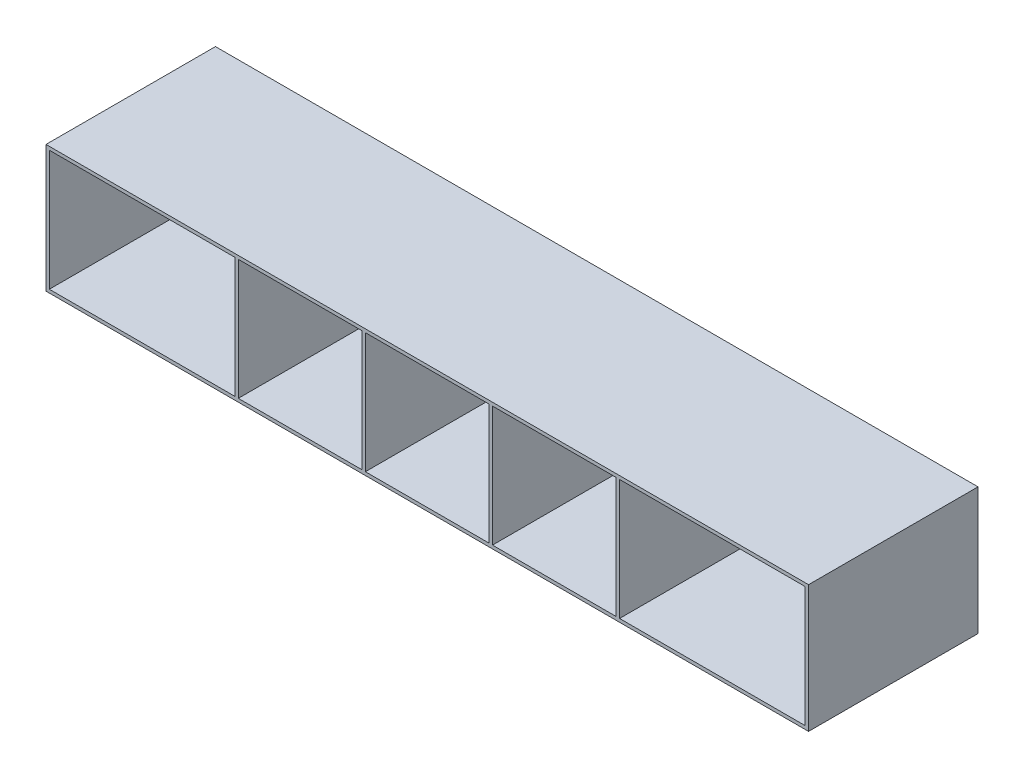
ISO-10303-21;
HEADER;
FILE_DESCRIPTION(('STEP AP214'),'2;1');
FILE_NAME('part.step','',(''),(''),'','','');
FILE_SCHEMA(('AUTOMOTIVE_DESIGN { 1 0 10303 214 1 1 1 1 }'));
ENDSEC;
DATA;
#1=APPLICATION_CONTEXT('core data for automotive mechanical design processes');
#2=APPLICATION_PROTOCOL_DEFINITION('international standard','automotive_design',2000,#1);
#3=PRODUCT_CONTEXT('',#1,'mechanical');
#4=PRODUCT('Part','Part','',(#3));
#5=PRODUCT_RELATED_PRODUCT_CATEGORY('part','',(#4));
#6=PRODUCT_DEFINITION_FORMATION('','',#4);
#7=PRODUCT_DEFINITION_CONTEXT('part definition',#1,'design');
#8=PRODUCT_DEFINITION('design','',#6,#7);
#9=PRODUCT_DEFINITION_SHAPE('','',#8);
#10=(LENGTH_UNIT() NAMED_UNIT(*) SI_UNIT(.MILLI.,.METRE.));
#11=(NAMED_UNIT(*) PLANE_ANGLE_UNIT() SI_UNIT($,.RADIAN.));
#12=(NAMED_UNIT(*) SI_UNIT($,.STERADIAN.) SOLID_ANGLE_UNIT());
#13=UNCERTAINTY_MEASURE_WITH_UNIT(LENGTH_MEASURE(1.E-05),#10,'distance_accuracy_value','');
#14=(GEOMETRIC_REPRESENTATION_CONTEXT(3) GLOBAL_UNCERTAINTY_ASSIGNED_CONTEXT((#13)) GLOBAL_UNIT_ASSIGNED_CONTEXT((#10,
#11,#12)) REPRESENTATION_CONTEXT('',''));
#15=CARTESIAN_POINT('',(0.,0.,0.));
#16=DIRECTION('',(0.,0.,1.));
#17=DIRECTION('',(1.,0.,0.));
#18=AXIS2_PLACEMENT_3D('',#15,#16,#17);
#19=CARTESIAN_POINT('',(0.,0.,101.6));
#20=DIRECTION('',(0.,0.,1.));
#21=DIRECTION('',(1.,0.,0.));
#22=AXIS2_PLACEMENT_3D('',#19,#20,#21);
#23=PLANE('',#22);
#24=DIRECTION('',(0.,1.,0.));
#25=VECTOR('',#24,1.);
#26=CARTESIAN_POINT('',(115.3,0.,101.6));
#27=LINE('',#26,#25);
#28=CARTESIAN_POINT('',(115.3,-36.1,101.6));
#29=VERTEX_POINT('',#28);
#30=CARTESIAN_POINT('',(115.3,36.1,101.6));
#31=VERTEX_POINT('',#30);
#32=EDGE_CURVE('E207',#29,#31,#27,.T.);
#33=ORIENTED_EDGE('',*,*,#32,.T.);
#34=DIRECTION('',(1.,0.,0.));
#35=VECTOR('',#34,1.);
#36=CARTESIAN_POINT('',(0.,36.1,101.6));
#37=LINE('',#36,#35);
#38=CARTESIAN_POINT('',(226.6,36.1,101.6));
#39=VERTEX_POINT('',#38);
#40=EDGE_CURVE('E217',#31,#39,#37,.T.);
#41=ORIENTED_EDGE('',*,*,#40,.T.);
#42=DIRECTION('',(0.,-1.,0.));
#43=VECTOR('',#42,1.);
#44=CARTESIAN_POINT('',(226.6,0.,101.6));
#45=LINE('',#44,#43);
#46=CARTESIAN_POINT('',(226.6,-36.1,101.6));
#47=VERTEX_POINT('',#46);
#48=EDGE_CURVE('E50',#39,#47,#45,.T.);
#49=ORIENTED_EDGE('',*,*,#48,.T.);
#50=DIRECTION('',(1.,0.,0.));
#51=VECTOR('',#50,1.);
#52=CARTESIAN_POINT('',(0.,-36.1,101.6));
#53=LINE('',#52,#51);
#54=EDGE_CURVE('E200',#29,#47,#53,.T.);
#55=ORIENTED_EDGE('',*,*,#54,.F.);
#56=EDGE_LOOP('',(#33,#41,#49,#55));
#57=FACE_BOUND('',#56,.T.);
#58=DIRECTION('',(0.,-1.,0.));
#59=VECTOR('',#58,1.);
#60=CARTESIAN_POINT('',(-228.6,38.1,101.6));
#61=LINE('',#60,#59);
#62=CARTESIAN_POINT('',(-228.6,38.1,101.6));
#63=VERTEX_POINT('',#62);
#64=CARTESIAN_POINT('',(-228.6,-38.1,101.6));
#65=VERTEX_POINT('',#64);
#66=EDGE_CURVE('E359',#63,#65,#61,.T.);
#67=ORIENTED_EDGE('',*,*,#66,.T.);
#68=DIRECTION('',(1.,0.,0.));
#69=VECTOR('',#68,1.);
#70=CARTESIAN_POINT('',(-228.6,-38.1,101.6));
#71=LINE('',#70,#69);
#72=CARTESIAN_POINT('',(228.6,-38.1,101.6));
#73=VERTEX_POINT('',#72);
#74=EDGE_CURVE('E362',#65,#73,#71,.T.);
#75=ORIENTED_EDGE('',*,*,#74,.T.);
#76=DIRECTION('',(0.,-1.,0.));
#77=VECTOR('',#76,1.);
#78=CARTESIAN_POINT('',(228.6,38.1,101.6));
#79=LINE('',#78,#77);
#80=CARTESIAN_POINT('',(228.6,38.1,101.6));
#81=VERTEX_POINT('',#80);
#82=EDGE_CURVE('E365',#81,#73,#79,.T.);
#83=ORIENTED_EDGE('',*,*,#82,.F.);
#84=DIRECTION('',(1.,0.,0.));
#85=VECTOR('',#84,1.);
#86=CARTESIAN_POINT('',(-228.6,38.1,101.6));
#87=LINE('',#86,#85);
#88=EDGE_CURVE('E368',#63,#81,#87,.T.);
#89=ORIENTED_EDGE('',*,*,#88,.F.);
#90=EDGE_LOOP('',(#67,#75,#83,#89));
#91=FACE_BOUND('',#90,.T.);
#92=DIRECTION('',(0.,1.,0.));
#93=VECTOR('',#92,1.);
#94=CARTESIAN_POINT('',(-115.3,0.,101.6));
#95=LINE('',#94,#93);
#96=CARTESIAN_POINT('',(-115.3,-36.1,101.6));
#97=VERTEX_POINT('',#96);
#98=CARTESIAN_POINT('',(-115.3,36.1,101.6));
#99=VERTEX_POINT('',#98);
#100=EDGE_CURVE('E330',#97,#99,#95,.T.);
#101=ORIENTED_EDGE('',*,*,#100,.F.);
#102=DIRECTION('',(1.,0.,0.));
#103=VECTOR('',#102,1.);
#104=CARTESIAN_POINT('',(0.,-36.1,101.6));
#105=LINE('',#104,#103);
#106=CARTESIAN_POINT('',(-226.6,-36.1,101.6));
#107=VERTEX_POINT('',#106);
#108=EDGE_CURVE('E328',#107,#97,#105,.T.);
#109=ORIENTED_EDGE('',*,*,#108,.F.);
#110=DIRECTION('',(0.,-1.,0.));
#111=VECTOR('',#110,1.);
#112=CARTESIAN_POINT('',(-226.6,0.,101.6));
#113=LINE('',#112,#111);
#114=CARTESIAN_POINT('',(-226.6,36.1,101.6));
#115=VERTEX_POINT('',#114);
#116=EDGE_CURVE('E336',#115,#107,#113,.T.);
#117=ORIENTED_EDGE('',*,*,#116,.F.);
#118=DIRECTION('',(1.,0.,0.));
#119=VECTOR('',#118,1.);
#120=CARTESIAN_POINT('',(0.,36.1,101.6));
#121=LINE('',#120,#119);
#122=EDGE_CURVE('E333',#115,#99,#121,.T.);
#123=ORIENTED_EDGE('',*,*,#122,.T.);
#124=EDGE_LOOP('',(#101,#109,#117,#123));
#125=FACE_BOUND('',#124,.T.);
#126=DIRECTION('',(0.,1.,0.));
#127=VECTOR('',#126,1.);
#128=CARTESIAN_POINT('',(113.3,0.,101.6));
#129=LINE('',#128,#127);
#130=CARTESIAN_POINT('',(113.3,-36.1,101.6));
#131=VERTEX_POINT('',#130);
#132=CARTESIAN_POINT('',(113.3,36.1,101.6));
#133=VERTEX_POINT('',#132);
#134=EDGE_CURVE('E298',#131,#133,#129,.T.);
#135=ORIENTED_EDGE('',*,*,#134,.F.);
#136=DIRECTION('',(1.,0.,0.));
#137=VECTOR('',#136,1.);
#138=CARTESIAN_POINT('',(0.,-36.1,101.6));
#139=LINE('',#138,#137);
#140=CARTESIAN_POINT('',(39.1,-36.1,101.6));
#141=VERTEX_POINT('',#140);
#142=EDGE_CURVE('E296',#141,#131,#139,.T.);
#143=ORIENTED_EDGE('',*,*,#142,.F.);
#144=DIRECTION('',(0.,1.,0.));
#145=VECTOR('',#144,1.);
#146=CARTESIAN_POINT('',(39.1,0.,101.6));
#147=LINE('',#146,#145);
#148=CARTESIAN_POINT('',(39.1,36.1,101.6));
#149=VERTEX_POINT('',#148);
#150=EDGE_CURVE('E304',#141,#149,#147,.T.);
#151=ORIENTED_EDGE('',*,*,#150,.T.);
#152=DIRECTION('',(1.,0.,0.));
#153=VECTOR('',#152,1.);
#154=CARTESIAN_POINT('',(0.,36.1,101.6));
#155=LINE('',#154,#153);
#156=EDGE_CURVE('E301',#149,#133,#155,.T.);
#157=ORIENTED_EDGE('',*,*,#156,.T.);
#158=EDGE_LOOP('',(#135,#143,#151,#157));
#159=FACE_BOUND('',#158,.T.);
#160=DIRECTION('',(0.,1.,0.));
#161=VECTOR('',#160,1.);
#162=CARTESIAN_POINT('',(37.1,0.,101.6));
#163=LINE('',#162,#161);
#164=CARTESIAN_POINT('',(37.1,-36.1,101.6));
#165=VERTEX_POINT('',#164);
#166=CARTESIAN_POINT('',(37.1,36.1,101.6));
#167=VERTEX_POINT('',#166);
#168=EDGE_CURVE('E266',#165,#167,#163,.T.);
#169=ORIENTED_EDGE('',*,*,#168,.F.);
#170=DIRECTION('',(1.,0.,0.));
#171=VECTOR('',#170,1.);
#172=CARTESIAN_POINT('',(0.,-36.1,101.6));
#173=LINE('',#172,#171);
#174=CARTESIAN_POINT('',(-37.1,-36.1,101.6));
#175=VERTEX_POINT('',#174);
#176=EDGE_CURVE('E264',#175,#165,#173,.T.);
#177=ORIENTED_EDGE('',*,*,#176,.F.);
#178=DIRECTION('',(0.,1.,0.));
#179=VECTOR('',#178,1.);
#180=CARTESIAN_POINT('',(-37.1,0.,101.6));
#181=LINE('',#180,#179);
#182=CARTESIAN_POINT('',(-37.1,36.1,101.6));
#183=VERTEX_POINT('',#182);
#184=EDGE_CURVE('E272',#175,#183,#181,.T.);
#185=ORIENTED_EDGE('',*,*,#184,.T.);
#186=DIRECTION('',(1.,0.,0.));
#187=VECTOR('',#186,1.);
#188=CARTESIAN_POINT('',(0.,36.1,101.6));
#189=LINE('',#188,#187);
#190=EDGE_CURVE('E269',#183,#167,#189,.T.);
#191=ORIENTED_EDGE('',*,*,#190,.T.);
#192=EDGE_LOOP('',(#169,#177,#185,#191));
#193=FACE_BOUND('',#192,.T.);
#194=DIRECTION('',(0.,1.,0.));
#195=VECTOR('',#194,1.);
#196=CARTESIAN_POINT('',(-39.1,0.,101.6));
#197=LINE('',#196,#195);
#198=CARTESIAN_POINT('',(-39.1,-36.1,101.6));
#199=VERTEX_POINT('',#198);
#200=CARTESIAN_POINT('',(-39.1,36.1,101.6));
#201=VERTEX_POINT('',#200);
#202=EDGE_CURVE('E234',#199,#201,#197,.T.);
#203=ORIENTED_EDGE('',*,*,#202,.F.);
#204=DIRECTION('',(1.,0.,0.));
#205=VECTOR('',#204,1.);
#206=CARTESIAN_POINT('',(0.,-36.1,101.6));
#207=LINE('',#206,#205);
#208=CARTESIAN_POINT('',(-113.3,-36.1,101.6));
#209=VERTEX_POINT('',#208);
#210=EDGE_CURVE('E232',#209,#199,#207,.T.);
#211=ORIENTED_EDGE('',*,*,#210,.F.);
#212=DIRECTION('',(0.,1.,0.));
#213=VECTOR('',#212,1.);
#214=CARTESIAN_POINT('',(-113.3,0.,101.6));
#215=LINE('',#214,#213);
#216=CARTESIAN_POINT('',(-113.3,36.1,101.6));
#217=VERTEX_POINT('',#216);
#218=EDGE_CURVE('E240',#209,#217,#215,.T.);
#219=ORIENTED_EDGE('',*,*,#218,.T.);
#220=DIRECTION('',(1.,0.,0.));
#221=VECTOR('',#220,1.);
#222=CARTESIAN_POINT('',(0.,36.1,101.6));
#223=LINE('',#222,#221);
#224=EDGE_CURVE('E237',#217,#201,#223,.T.);
#225=ORIENTED_EDGE('',*,*,#224,.T.);
#226=EDGE_LOOP('',(#203,#211,#219,#225));
#227=FACE_BOUND('',#226,.T.);
#228=ADVANCED_FACE('F35',(#57,#91,#125,#159,#193,#227),#23,.T.);
#229=CARTESIAN_POINT('',(0.,0.,0.));
#230=DIRECTION('',(0.,0.,1.));
#231=DIRECTION('',(1.,0.,0.));
#232=AXIS2_PLACEMENT_3D('',#229,#230,#231);
#233=PLANE('',#232);
#234=DIRECTION('',(1.,0.,0.));
#235=VECTOR('',#234,1.);
#236=CARTESIAN_POINT('',(0.,36.1,0.));
#237=LINE('',#236,#235);
#238=CARTESIAN_POINT('',(115.3,36.1,0.));
#239=VERTEX_POINT('',#238);
#240=CARTESIAN_POINT('',(226.6,36.1,0.));
#241=VERTEX_POINT('',#240);
#242=EDGE_CURVE('E213',#239,#241,#237,.T.);
#243=ORIENTED_EDGE('',*,*,#242,.F.);
#244=DIRECTION('',(0.,1.,0.));
#245=VECTOR('',#244,1.);
#246=CARTESIAN_POINT('',(115.3,0.,0.));
#247=LINE('',#246,#245);
#248=CARTESIAN_POINT('',(115.3,-36.1,0.));
#249=VERTEX_POINT('',#248);
#250=EDGE_CURVE('E58',#249,#239,#247,.T.);
#251=ORIENTED_EDGE('',*,*,#250,.F.);
#252=DIRECTION('',(1.,0.,0.));
#253=VECTOR('',#252,1.);
#254=CARTESIAN_POINT('',(0.,-36.1,0.));
#255=LINE('',#254,#253);
#256=CARTESIAN_POINT('',(226.6,-36.1,0.));
#257=VERTEX_POINT('',#256);
#258=EDGE_CURVE('E202',#249,#257,#255,.T.);
#259=ORIENTED_EDGE('',*,*,#258,.T.);
#260=DIRECTION('',(0.,-1.,0.));
#261=VECTOR('',#260,1.);
#262=CARTESIAN_POINT('',(226.6,0.,0.));
#263=LINE('',#262,#261);
#264=EDGE_CURVE('E223',#241,#257,#263,.T.);
#265=ORIENTED_EDGE('',*,*,#264,.F.);
#266=EDGE_LOOP('',(#243,#251,#259,#265));
#267=FACE_BOUND('',#266,.T.);
#268=DIRECTION('',(1.,0.,0.));
#269=VECTOR('',#268,1.);
#270=CARTESIAN_POINT('',(0.,-36.1,0.));
#271=LINE('',#270,#269);
#272=CARTESIAN_POINT('',(-37.1,-36.1,0.));
#273=VERTEX_POINT('',#272);
#274=CARTESIAN_POINT('',(37.1,-36.1,0.));
#275=VERTEX_POINT('',#274);
#276=EDGE_CURVE('E263',#273,#275,#271,.T.);
#277=ORIENTED_EDGE('',*,*,#276,.T.);
#278=DIRECTION('',(0.,1.,0.));
#279=VECTOR('',#278,1.);
#280=CARTESIAN_POINT('',(37.1,0.,0.));
#281=LINE('',#280,#279);
#282=CARTESIAN_POINT('',(37.1,36.1,0.));
#283=VERTEX_POINT('',#282);
#284=EDGE_CURVE('E278',#275,#283,#281,.T.);
#285=ORIENTED_EDGE('',*,*,#284,.T.);
#286=DIRECTION('',(1.,0.,0.));
#287=VECTOR('',#286,1.);
#288=CARTESIAN_POINT('',(0.,36.1,0.));
#289=LINE('',#288,#287);
#290=CARTESIAN_POINT('',(-37.1,36.1,0.));
#291=VERTEX_POINT('',#290);
#292=EDGE_CURVE('E281',#291,#283,#289,.T.);
#293=ORIENTED_EDGE('',*,*,#292,.F.);
#294=DIRECTION('',(0.,1.,0.));
#295=VECTOR('',#294,1.);
#296=CARTESIAN_POINT('',(-37.1,0.,0.));
#297=LINE('',#296,#295);
#298=EDGE_CURVE('E267',#273,#291,#297,.T.);
#299=ORIENTED_EDGE('',*,*,#298,.F.);
#300=EDGE_LOOP('',(#277,#285,#293,#299));
#301=FACE_BOUND('',#300,.T.);
#302=DIRECTION('',(1.,0.,0.));
#303=VECTOR('',#302,1.);
#304=CARTESIAN_POINT('',(0.,-36.1,0.));
#305=LINE('',#304,#303);
#306=CARTESIAN_POINT('',(-226.6,-36.1,0.));
#307=VERTEX_POINT('',#306);
#308=CARTESIAN_POINT('',(-115.3,-36.1,0.));
#309=VERTEX_POINT('',#308);
#310=EDGE_CURVE('E327',#307,#309,#305,.T.);
#311=ORIENTED_EDGE('',*,*,#310,.T.);
#312=DIRECTION('',(0.,1.,0.));
#313=VECTOR('',#312,1.);
#314=CARTESIAN_POINT('',(-115.3,0.,0.));
#315=LINE('',#314,#313);
#316=CARTESIAN_POINT('',(-115.3,36.1,0.));
#317=VERTEX_POINT('',#316);
#318=EDGE_CURVE('E341',#309,#317,#315,.T.);
#319=ORIENTED_EDGE('',*,*,#318,.T.);
#320=DIRECTION('',(1.,0.,0.));
#321=VECTOR('',#320,1.);
#322=CARTESIAN_POINT('',(0.,36.1,0.));
#323=LINE('',#322,#321);
#324=CARTESIAN_POINT('',(-226.6,36.1,0.));
#325=VERTEX_POINT('',#324);
#326=EDGE_CURVE('E344',#325,#317,#323,.T.);
#327=ORIENTED_EDGE('',*,*,#326,.F.);
#328=DIRECTION('',(0.,-1.,0.));
#329=VECTOR('',#328,1.);
#330=CARTESIAN_POINT('',(-226.6,0.,0.));
#331=LINE('',#330,#329);
#332=EDGE_CURVE('E331',#325,#307,#331,.T.);
#333=ORIENTED_EDGE('',*,*,#332,.T.);
#334=EDGE_LOOP('',(#311,#319,#327,#333));
#335=FACE_BOUND('',#334,.T.);
#336=DIRECTION('',(0.,-1.,0.));
#337=VECTOR('',#336,1.);
#338=CARTESIAN_POINT('',(-228.6,38.1,0.));
#339=LINE('',#338,#337);
#340=CARTESIAN_POINT('',(-228.6,38.1,0.));
#341=VERTEX_POINT('',#340);
#342=CARTESIAN_POINT('',(-228.6,-38.1,0.));
#343=VERTEX_POINT('',#342);
#344=EDGE_CURVE('E358',#341,#343,#339,.T.);
#345=ORIENTED_EDGE('',*,*,#344,.F.);
#346=DIRECTION('',(1.,0.,0.));
#347=VECTOR('',#346,1.);
#348=CARTESIAN_POINT('',(-228.6,38.1,0.));
#349=LINE('',#348,#347);
#350=CARTESIAN_POINT('',(228.6,38.1,0.));
#351=VERTEX_POINT('',#350);
#352=EDGE_CURVE('E363',#341,#351,#349,.T.);
#353=ORIENTED_EDGE('',*,*,#352,.T.);
#354=DIRECTION('',(0.,-1.,0.));
#355=VECTOR('',#354,1.);
#356=CARTESIAN_POINT('',(228.6,38.1,0.));
#357=LINE('',#356,#355);
#358=CARTESIAN_POINT('',(228.6,-38.1,0.));
#359=VERTEX_POINT('',#358);
#360=EDGE_CURVE('E377',#351,#359,#357,.T.);
#361=ORIENTED_EDGE('',*,*,#360,.T.);
#362=DIRECTION('',(1.,0.,0.));
#363=VECTOR('',#362,1.);
#364=CARTESIAN_POINT('',(-228.6,-38.1,0.));
#365=LINE('',#364,#363);
#366=EDGE_CURVE('E374',#343,#359,#365,.T.);
#367=ORIENTED_EDGE('',*,*,#366,.F.);
#368=EDGE_LOOP('',(#345,#353,#361,#367));
#369=FACE_BOUND('',#368,.T.);
#370=DIRECTION('',(1.,0.,0.));
#371=VECTOR('',#370,1.);
#372=CARTESIAN_POINT('',(0.,-36.1,0.));
#373=LINE('',#372,#371);
#374=CARTESIAN_POINT('',(39.1,-36.1,0.));
#375=VERTEX_POINT('',#374);
#376=CARTESIAN_POINT('',(113.3,-36.1,0.));
#377=VERTEX_POINT('',#376);
#378=EDGE_CURVE('E295',#375,#377,#373,.T.);
#379=ORIENTED_EDGE('',*,*,#378,.T.);
#380=DIRECTION('',(0.,1.,0.));
#381=VECTOR('',#380,1.);
#382=CARTESIAN_POINT('',(113.3,0.,0.));
#383=LINE('',#382,#381);
#384=CARTESIAN_POINT('',(113.3,36.1,0.));
#385=VERTEX_POINT('',#384);
#386=EDGE_CURVE('E310',#377,#385,#383,.T.);
#387=ORIENTED_EDGE('',*,*,#386,.T.);
#388=DIRECTION('',(1.,0.,0.));
#389=VECTOR('',#388,1.);
#390=CARTESIAN_POINT('',(0.,36.1,0.));
#391=LINE('',#390,#389);
#392=CARTESIAN_POINT('',(39.1,36.1,0.));
#393=VERTEX_POINT('',#392);
#394=EDGE_CURVE('E313',#393,#385,#391,.T.);
#395=ORIENTED_EDGE('',*,*,#394,.F.);
#396=DIRECTION('',(0.,1.,0.));
#397=VECTOR('',#396,1.);
#398=CARTESIAN_POINT('',(39.1,0.,0.));
#399=LINE('',#398,#397);
#400=EDGE_CURVE('E299',#375,#393,#399,.T.);
#401=ORIENTED_EDGE('',*,*,#400,.F.);
#402=EDGE_LOOP('',(#379,#387,#395,#401));
#403=FACE_BOUND('',#402,.T.);
#404=DIRECTION('',(1.,0.,0.));
#405=VECTOR('',#404,1.);
#406=CARTESIAN_POINT('',(0.,-36.1,0.));
#407=LINE('',#406,#405);
#408=CARTESIAN_POINT('',(-113.3,-36.1,0.));
#409=VERTEX_POINT('',#408);
#410=CARTESIAN_POINT('',(-39.1,-36.1,0.));
#411=VERTEX_POINT('',#410);
#412=EDGE_CURVE('E203',#409,#411,#407,.T.);
#413=ORIENTED_EDGE('',*,*,#412,.T.);
#414=DIRECTION('',(0.,1.,0.));
#415=VECTOR('',#414,1.);
#416=CARTESIAN_POINT('',(-39.1,0.,0.));
#417=LINE('',#416,#415);
#418=CARTESIAN_POINT('',(-39.1,36.1,0.));
#419=VERTEX_POINT('',#418);
#420=EDGE_CURVE('E246',#411,#419,#417,.T.);
#421=ORIENTED_EDGE('',*,*,#420,.T.);
#422=DIRECTION('',(1.,0.,0.));
#423=VECTOR('',#422,1.);
#424=CARTESIAN_POINT('',(0.,36.1,0.));
#425=LINE('',#424,#423);
#426=CARTESIAN_POINT('',(-113.3,36.1,0.));
#427=VERTEX_POINT('',#426);
#428=EDGE_CURVE('E249',#427,#419,#425,.T.);
#429=ORIENTED_EDGE('',*,*,#428,.F.);
#430=DIRECTION('',(0.,1.,0.));
#431=VECTOR('',#430,1.);
#432=CARTESIAN_POINT('',(-113.3,0.,0.));
#433=LINE('',#432,#431);
#434=EDGE_CURVE('E235',#409,#427,#433,.T.);
#435=ORIENTED_EDGE('',*,*,#434,.F.);
#436=EDGE_LOOP('',(#413,#421,#429,#435));
#437=FACE_BOUND('',#436,.T.);
#438=ADVANCED_FACE('F394',(#267,#301,#335,#369,#403,#437),#233,.F.);
#439=CARTESIAN_POINT('',(-228.6,38.1,101.6));
#440=DIRECTION('',(1.,0.,0.));
#441=DIRECTION('',(0.,0.,-1.));
#442=AXIS2_PLACEMENT_3D('',#439,#440,#441);
#443=PLANE('',#442);
#444=ORIENTED_EDGE('',*,*,#344,.T.);
#445=DIRECTION('',(0.,0.,-1.));
#446=VECTOR('',#445,1.);
#447=CARTESIAN_POINT('',(-228.6,-38.1,101.6));
#448=LINE('',#447,#446);
#449=EDGE_CURVE('E11',#65,#343,#448,.T.);
#450=ORIENTED_EDGE('',*,*,#449,.F.);
#451=ORIENTED_EDGE('',*,*,#66,.F.);
#452=DIRECTION('',(0.,0.,-1.));
#453=VECTOR('',#452,1.);
#454=CARTESIAN_POINT('',(-228.6,38.1,101.6));
#455=LINE('',#454,#453);
#456=EDGE_CURVE('E371',#63,#341,#455,.T.);
#457=ORIENTED_EDGE('',*,*,#456,.T.);
#458=EDGE_LOOP('',(#444,#450,#451,#457));
#459=FACE_BOUND('',#458,.T.);
#460=ADVANCED_FACE('F37',(#459),#443,.F.);
#461=CARTESIAN_POINT('',(-228.6,-38.1,101.6));
#462=DIRECTION('',(0.,1.,0.));
#463=DIRECTION('',(-1.,0.,0.));
#464=AXIS2_PLACEMENT_3D('',#461,#462,#463);
#465=PLANE('',#464);
#466=ORIENTED_EDGE('',*,*,#366,.T.);
#467=DIRECTION('',(0.,0.,-1.));
#468=VECTOR('',#467,1.);
#469=CARTESIAN_POINT('',(228.6,-38.1,101.6));
#470=LINE('',#469,#468);
#471=EDGE_CURVE('E43',#73,#359,#470,.T.);
#472=ORIENTED_EDGE('',*,*,#471,.F.);
#473=ORIENTED_EDGE('',*,*,#74,.F.);
#474=ORIENTED_EDGE('',*,*,#449,.T.);
#475=EDGE_LOOP('',(#466,#472,#473,#474));
#476=FACE_BOUND('',#475,.T.);
#477=ADVANCED_FACE('F390',(#476),#465,.F.);
#478=CARTESIAN_POINT('',(228.6,38.1,101.6));
#479=DIRECTION('',(1.,0.,0.));
#480=DIRECTION('',(0.,1.,0.));
#481=AXIS2_PLACEMENT_3D('',#478,#479,#480);
#482=PLANE('',#481);
#483=ORIENTED_EDGE('',*,*,#360,.F.);
#484=DIRECTION('',(0.,0.,-1.));
#485=VECTOR('',#484,1.);
#486=CARTESIAN_POINT('',(228.6,38.1,101.6));
#487=LINE('',#486,#485);
#488=EDGE_CURVE('E383',#81,#351,#487,.T.);
#489=ORIENTED_EDGE('',*,*,#488,.F.);
#490=ORIENTED_EDGE('',*,*,#82,.T.);
#491=ORIENTED_EDGE('',*,*,#471,.T.);
#492=EDGE_LOOP('',(#483,#489,#490,#491));
#493=FACE_BOUND('',#492,.T.);
#494=ADVANCED_FACE('F387',(#493),#482,.T.);
#495=CARTESIAN_POINT('',(-228.6,38.1,101.6));
#496=DIRECTION('',(0.,1.,0.));
#497=DIRECTION('',(0.,0.,1.));
#498=AXIS2_PLACEMENT_3D('',#495,#496,#497);
#499=PLANE('',#498);
#500=ORIENTED_EDGE('',*,*,#352,.F.);
#501=ORIENTED_EDGE('',*,*,#456,.F.);
#502=ORIENTED_EDGE('',*,*,#88,.T.);
#503=ORIENTED_EDGE('',*,*,#488,.T.);
#504=EDGE_LOOP('',(#500,#501,#502,#503));
#505=FACE_BOUND('',#504,.T.);
#506=ADVANCED_FACE('F398',(#505),#499,.T.);
#507=CARTESIAN_POINT('',(0.,-36.1,101.6));
#508=DIRECTION('',(0.,1.,0.));
#509=DIRECTION('',(0.,0.,1.));
#510=AXIS2_PLACEMENT_3D('',#507,#508,#509);
#511=PLANE('',#510);
#512=ORIENTED_EDGE('',*,*,#310,.F.);
#513=DIRECTION('',(0.,0.,-1.));
#514=VECTOR('',#513,1.);
#515=CARTESIAN_POINT('',(-226.6,-36.1,101.6));
#516=LINE('',#515,#514);
#517=EDGE_CURVE('E338',#107,#307,#516,.T.);
#518=ORIENTED_EDGE('',*,*,#517,.F.);
#519=ORIENTED_EDGE('',*,*,#108,.T.);
#520=DIRECTION('',(0.,0.,-1.));
#521=VECTOR('',#520,1.);
#522=CARTESIAN_POINT('',(-115.3,-36.1,101.6));
#523=LINE('',#522,#521);
#524=EDGE_CURVE('E355',#97,#309,#523,.T.);
#525=ORIENTED_EDGE('',*,*,#524,.T.);
#526=EDGE_LOOP('',(#512,#518,#519,#525));
#527=FACE_BOUND('',#526,.T.);
#528=ADVANCED_FACE('F415',(#527),#511,.T.);
#529=CARTESIAN_POINT('',(-115.3,0.,101.6));
#530=DIRECTION('',(-1.,0.,0.));
#531=DIRECTION('',(0.,0.,1.));
#532=AXIS2_PLACEMENT_3D('',#529,#530,#531);
#533=PLANE('',#532);
#534=ORIENTED_EDGE('',*,*,#318,.F.);
#535=ORIENTED_EDGE('',*,*,#524,.F.);
#536=ORIENTED_EDGE('',*,*,#100,.T.);
#537=DIRECTION('',(0.,0.,-1.));
#538=VECTOR('',#537,1.);
#539=CARTESIAN_POINT('',(-115.3,36.1,101.6));
#540=LINE('',#539,#538);
#541=EDGE_CURVE('E353',#99,#317,#540,.T.);
#542=ORIENTED_EDGE('',*,*,#541,.T.);
#543=EDGE_LOOP('',(#534,#535,#536,#542));
#544=FACE_BOUND('',#543,.T.);
#545=ADVANCED_FACE('F435',(#544),#533,.T.);
#546=CARTESIAN_POINT('',(0.,36.1,101.6));
#547=DIRECTION('',(0.,1.,0.));
#548=DIRECTION('',(0.,0.,1.));
#549=AXIS2_PLACEMENT_3D('',#546,#547,#548);
#550=PLANE('',#549);
#551=ORIENTED_EDGE('',*,*,#326,.T.);
#552=ORIENTED_EDGE('',*,*,#541,.F.);
#553=ORIENTED_EDGE('',*,*,#122,.F.);
#554=DIRECTION('',(0.,0.,-1.));
#555=VECTOR('',#554,1.);
#556=CARTESIAN_POINT('',(-226.6,36.1,101.6));
#557=LINE('',#556,#555);
#558=EDGE_CURVE('E351',#115,#325,#557,.T.);
#559=ORIENTED_EDGE('',*,*,#558,.T.);
#560=EDGE_LOOP('',(#551,#552,#553,#559));
#561=FACE_BOUND('',#560,.T.);
#562=ADVANCED_FACE('F443',(#561),#550,.F.);
#563=CARTESIAN_POINT('',(-226.6,0.,101.6));
#564=DIRECTION('',(1.,0.,0.));
#565=DIRECTION('',(0.,0.,-1.));
#566=AXIS2_PLACEMENT_3D('',#563,#564,#565);
#567=PLANE('',#566);
#568=ORIENTED_EDGE('',*,*,#332,.F.);
#569=ORIENTED_EDGE('',*,*,#558,.F.);
#570=ORIENTED_EDGE('',*,*,#116,.T.);
#571=ORIENTED_EDGE('',*,*,#517,.T.);
#572=EDGE_LOOP('',(#568,#569,#570,#571));
#573=FACE_BOUND('',#572,.T.);
#574=ADVANCED_FACE('F450',(#573),#567,.T.);
#575=CARTESIAN_POINT('',(0.,-36.1,101.6));
#576=DIRECTION('',(0.,1.,0.));
#577=DIRECTION('',(0.,0.,1.));
#578=AXIS2_PLACEMENT_3D('',#575,#576,#577);
#579=PLANE('',#578);
#580=ORIENTED_EDGE('',*,*,#378,.F.);
#581=DIRECTION('',(0.,0.,-1.));
#582=VECTOR('',#581,1.);
#583=CARTESIAN_POINT('',(39.1,-36.1,101.6));
#584=LINE('',#583,#582);
#585=EDGE_CURVE('E307',#141,#375,#584,.T.);
#586=ORIENTED_EDGE('',*,*,#585,.F.);
#587=ORIENTED_EDGE('',*,*,#142,.T.);
#588=DIRECTION('',(0.,0.,-1.));
#589=VECTOR('',#588,1.);
#590=CARTESIAN_POINT('',(113.3,-36.1,101.6));
#591=LINE('',#590,#589);
#592=EDGE_CURVE('E324',#131,#377,#591,.T.);
#593=ORIENTED_EDGE('',*,*,#592,.T.);
#594=EDGE_LOOP('',(#580,#586,#587,#593));
#595=FACE_BOUND('',#594,.T.);
#596=ADVANCED_FACE('F458',(#595),#579,.T.);
#597=CARTESIAN_POINT('',(113.3,0.,101.6));
#598=DIRECTION('',(-1.,0.,0.));
#599=DIRECTION('',(0.,0.,1.));
#600=AXIS2_PLACEMENT_3D('',#597,#598,#599);
#601=PLANE('',#600);
#602=ORIENTED_EDGE('',*,*,#386,.F.);
#603=ORIENTED_EDGE('',*,*,#592,.F.);
#604=ORIENTED_EDGE('',*,*,#134,.T.);
#605=DIRECTION('',(0.,0.,-1.));
#606=VECTOR('',#605,1.);
#607=CARTESIAN_POINT('',(113.3,36.1,101.6));
#608=LINE('',#607,#606);
#609=EDGE_CURVE('E322',#133,#385,#608,.T.);
#610=ORIENTED_EDGE('',*,*,#609,.T.);
#611=EDGE_LOOP('',(#602,#603,#604,#610));
#612=FACE_BOUND('',#611,.T.);
#613=ADVANCED_FACE('F466',(#612),#601,.T.);
#614=CARTESIAN_POINT('',(0.,36.1,101.6));
#615=DIRECTION('',(0.,1.,0.));
#616=DIRECTION('',(0.,0.,1.));
#617=AXIS2_PLACEMENT_3D('',#614,#615,#616);
#618=PLANE('',#617);
#619=ORIENTED_EDGE('',*,*,#394,.T.);
#620=ORIENTED_EDGE('',*,*,#609,.F.);
#621=ORIENTED_EDGE('',*,*,#156,.F.);
#622=DIRECTION('',(0.,0.,-1.));
#623=VECTOR('',#622,1.);
#624=CARTESIAN_POINT('',(39.1,36.1,101.6));
#625=LINE('',#624,#623);
#626=EDGE_CURVE('E320',#149,#393,#625,.T.);
#627=ORIENTED_EDGE('',*,*,#626,.T.);
#628=EDGE_LOOP('',(#619,#620,#621,#627));
#629=FACE_BOUND('',#628,.T.);
#630=ADVANCED_FACE('F474',(#629),#618,.F.);
#631=CARTESIAN_POINT('',(39.1,0.,101.6));
#632=DIRECTION('',(-1.,0.,0.));
#633=DIRECTION('',(0.,0.,1.));
#634=AXIS2_PLACEMENT_3D('',#631,#632,#633);
#635=PLANE('',#634);
#636=ORIENTED_EDGE('',*,*,#400,.T.);
#637=ORIENTED_EDGE('',*,*,#626,.F.);
#638=ORIENTED_EDGE('',*,*,#150,.F.);
#639=ORIENTED_EDGE('',*,*,#585,.T.);
#640=EDGE_LOOP('',(#636,#637,#638,#639));
#641=FACE_BOUND('',#640,.T.);
#642=ADVANCED_FACE('F482',(#641),#635,.F.);
#643=CARTESIAN_POINT('',(0.,-36.1,101.6));
#644=DIRECTION('',(0.,1.,0.));
#645=DIRECTION('',(0.,0.,1.));
#646=AXIS2_PLACEMENT_3D('',#643,#644,#645);
#647=PLANE('',#646);
#648=ORIENTED_EDGE('',*,*,#276,.F.);
#649=DIRECTION('',(0.,0.,-1.));
#650=VECTOR('',#649,1.);
#651=CARTESIAN_POINT('',(-37.1,-36.1,101.6));
#652=LINE('',#651,#650);
#653=EDGE_CURVE('E275',#175,#273,#652,.T.);
#654=ORIENTED_EDGE('',*,*,#653,.F.);
#655=ORIENTED_EDGE('',*,*,#176,.T.);
#656=DIRECTION('',(0.,0.,-1.));
#657=VECTOR('',#656,1.);
#658=CARTESIAN_POINT('',(37.1,-36.1,101.6));
#659=LINE('',#658,#657);
#660=EDGE_CURVE('E292',#165,#275,#659,.T.);
#661=ORIENTED_EDGE('',*,*,#660,.T.);
#662=EDGE_LOOP('',(#648,#654,#655,#661));
#663=FACE_BOUND('',#662,.T.);
#664=ADVANCED_FACE('F490',(#663),#647,.T.);
#665=CARTESIAN_POINT('',(37.1,0.,101.6));
#666=DIRECTION('',(-1.,0.,0.));
#667=DIRECTION('',(0.,0.,1.));
#668=AXIS2_PLACEMENT_3D('',#665,#666,#667);
#669=PLANE('',#668);
#670=ORIENTED_EDGE('',*,*,#284,.F.);
#671=ORIENTED_EDGE('',*,*,#660,.F.);
#672=ORIENTED_EDGE('',*,*,#168,.T.);
#673=DIRECTION('',(0.,0.,-1.));
#674=VECTOR('',#673,1.);
#675=CARTESIAN_POINT('',(37.1,36.1,101.6));
#676=LINE('',#675,#674);
#677=EDGE_CURVE('E290',#167,#283,#676,.T.);
#678=ORIENTED_EDGE('',*,*,#677,.T.);
#679=EDGE_LOOP('',(#670,#671,#672,#678));
#680=FACE_BOUND('',#679,.T.);
#681=ADVANCED_FACE('F498',(#680),#669,.T.);
#682=CARTESIAN_POINT('',(0.,36.1,101.6));
#683=DIRECTION('',(0.,1.,0.));
#684=DIRECTION('',(0.,0.,1.));
#685=AXIS2_PLACEMENT_3D('',#682,#683,#684);
#686=PLANE('',#685);
#687=ORIENTED_EDGE('',*,*,#292,.T.);
#688=ORIENTED_EDGE('',*,*,#677,.F.);
#689=ORIENTED_EDGE('',*,*,#190,.F.);
#690=DIRECTION('',(0.,0.,-1.));
#691=VECTOR('',#690,1.);
#692=CARTESIAN_POINT('',(-37.1,36.1,101.6));
#693=LINE('',#692,#691);
#694=EDGE_CURVE('E288',#183,#291,#693,.T.);
#695=ORIENTED_EDGE('',*,*,#694,.T.);
#696=EDGE_LOOP('',(#687,#688,#689,#695));
#697=FACE_BOUND('',#696,.T.);
#698=ADVANCED_FACE('F506',(#697),#686,.F.);
#699=CARTESIAN_POINT('',(-37.1,0.,101.6));
#700=DIRECTION('',(-1.,0.,0.));
#701=DIRECTION('',(0.,0.,1.));
#702=AXIS2_PLACEMENT_3D('',#699,#700,#701);
#703=PLANE('',#702);
#704=ORIENTED_EDGE('',*,*,#298,.T.);
#705=ORIENTED_EDGE('',*,*,#694,.F.);
#706=ORIENTED_EDGE('',*,*,#184,.F.);
#707=ORIENTED_EDGE('',*,*,#653,.T.);
#708=EDGE_LOOP('',(#704,#705,#706,#707));
#709=FACE_BOUND('',#708,.T.);
#710=ADVANCED_FACE('F514',(#709),#703,.F.);
#711=CARTESIAN_POINT('',(0.,-36.1,101.6));
#712=DIRECTION('',(0.,1.,0.));
#713=DIRECTION('',(0.,0.,1.));
#714=AXIS2_PLACEMENT_3D('',#711,#712,#713);
#715=PLANE('',#714);
#716=ORIENTED_EDGE('',*,*,#412,.F.);
#717=DIRECTION('',(0.,0.,-1.));
#718=VECTOR('',#717,1.);
#719=CARTESIAN_POINT('',(-113.3,-36.1,101.6));
#720=LINE('',#719,#718);
#721=EDGE_CURVE('E243',#209,#409,#720,.T.);
#722=ORIENTED_EDGE('',*,*,#721,.F.);
#723=ORIENTED_EDGE('',*,*,#210,.T.);
#724=DIRECTION('',(0.,0.,-1.));
#725=VECTOR('',#724,1.);
#726=CARTESIAN_POINT('',(-39.1,-36.1,101.6));
#727=LINE('',#726,#725);
#728=EDGE_CURVE('E260',#199,#411,#727,.T.);
#729=ORIENTED_EDGE('',*,*,#728,.T.);
#730=EDGE_LOOP('',(#716,#722,#723,#729));
#731=FACE_BOUND('',#730,.T.);
#732=ADVANCED_FACE('F522',(#731),#715,.T.);
#733=CARTESIAN_POINT('',(-39.1,0.,101.6));
#734=DIRECTION('',(-1.,0.,0.));
#735=DIRECTION('',(0.,0.,1.));
#736=AXIS2_PLACEMENT_3D('',#733,#734,#735);
#737=PLANE('',#736);
#738=ORIENTED_EDGE('',*,*,#420,.F.);
#739=ORIENTED_EDGE('',*,*,#728,.F.);
#740=ORIENTED_EDGE('',*,*,#202,.T.);
#741=DIRECTION('',(0.,0.,-1.));
#742=VECTOR('',#741,1.);
#743=CARTESIAN_POINT('',(-39.1,36.1,101.6));
#744=LINE('',#743,#742);
#745=EDGE_CURVE('E258',#201,#419,#744,.T.);
#746=ORIENTED_EDGE('',*,*,#745,.T.);
#747=EDGE_LOOP('',(#738,#739,#740,#746));
#748=FACE_BOUND('',#747,.T.);
#749=ADVANCED_FACE('F530',(#748),#737,.T.);
#750=CARTESIAN_POINT('',(0.,36.1,101.6));
#751=DIRECTION('',(0.,1.,0.));
#752=DIRECTION('',(0.,0.,1.));
#753=AXIS2_PLACEMENT_3D('',#750,#751,#752);
#754=PLANE('',#753);
#755=ORIENTED_EDGE('',*,*,#428,.T.);
#756=ORIENTED_EDGE('',*,*,#745,.F.);
#757=ORIENTED_EDGE('',*,*,#224,.F.);
#758=DIRECTION('',(0.,0.,-1.));
#759=VECTOR('',#758,1.);
#760=CARTESIAN_POINT('',(-113.3,36.1,101.6));
#761=LINE('',#760,#759);
#762=EDGE_CURVE('E256',#217,#427,#761,.T.);
#763=ORIENTED_EDGE('',*,*,#762,.T.);
#764=EDGE_LOOP('',(#755,#756,#757,#763));
#765=FACE_BOUND('',#764,.T.);
#766=ADVANCED_FACE('F538',(#765),#754,.F.);
#767=CARTESIAN_POINT('',(-113.3,0.,101.6));
#768=DIRECTION('',(-1.,0.,0.));
#769=DIRECTION('',(0.,0.,1.));
#770=AXIS2_PLACEMENT_3D('',#767,#768,#769);
#771=PLANE('',#770);
#772=ORIENTED_EDGE('',*,*,#434,.T.);
#773=ORIENTED_EDGE('',*,*,#762,.F.);
#774=ORIENTED_EDGE('',*,*,#218,.F.);
#775=ORIENTED_EDGE('',*,*,#721,.T.);
#776=EDGE_LOOP('',(#772,#773,#774,#775));
#777=FACE_BOUND('',#776,.T.);
#778=ADVANCED_FACE('F546',(#777),#771,.F.);
#779=CARTESIAN_POINT('',(115.3,0.,101.6));
#780=DIRECTION('',(-1.,0.,0.));
#781=DIRECTION('',(0.,0.,1.));
#782=AXIS2_PLACEMENT_3D('',#779,#780,#781);
#783=PLANE('',#782);
#784=ORIENTED_EDGE('',*,*,#250,.T.);
#785=DIRECTION('',(0.,0.,-1.));
#786=VECTOR('',#785,1.);
#787=CARTESIAN_POINT('',(115.3,36.1,101.6));
#788=LINE('',#787,#786);
#789=EDGE_CURVE('E209',#31,#239,#788,.T.);
#790=ORIENTED_EDGE('',*,*,#789,.F.);
#791=ORIENTED_EDGE('',*,*,#32,.F.);
#792=DIRECTION('',(0.,0.,-1.));
#793=VECTOR('',#792,1.);
#794=CARTESIAN_POINT('',(115.3,-36.1,101.6));
#795=LINE('',#794,#793);
#796=EDGE_CURVE('E196',#29,#249,#795,.T.);
#797=ORIENTED_EDGE('',*,*,#796,.T.);
#798=EDGE_LOOP('',(#784,#790,#791,#797));
#799=FACE_BOUND('',#798,.T.);
#800=ADVANCED_FACE('F208',(#799),#783,.F.);
#801=CARTESIAN_POINT('',(0.,-36.1,101.6));
#802=DIRECTION('',(0.,1.,0.));
#803=DIRECTION('',(0.,0.,1.));
#804=AXIS2_PLACEMENT_3D('',#801,#802,#803);
#805=PLANE('',#804);
#806=ORIENTED_EDGE('',*,*,#258,.F.);
#807=ORIENTED_EDGE('',*,*,#796,.F.);
#808=ORIENTED_EDGE('',*,*,#54,.T.);
#809=DIRECTION('',(0.,0.,-1.));
#810=VECTOR('',#809,1.);
#811=CARTESIAN_POINT('',(226.6,-36.1,101.6));
#812=LINE('',#811,#810);
#813=EDGE_CURVE('E204',#47,#257,#812,.T.);
#814=ORIENTED_EDGE('',*,*,#813,.T.);
#815=EDGE_LOOP('',(#806,#807,#808,#814));
#816=FACE_BOUND('',#815,.T.);
#817=ADVANCED_FACE('F198',(#816),#805,.T.);
#818=CARTESIAN_POINT('',(226.6,0.,101.6));
#819=DIRECTION('',(1.,0.,0.));
#820=DIRECTION('',(0.,0.,-1.));
#821=AXIS2_PLACEMENT_3D('',#818,#819,#820);
#822=PLANE('',#821);
#823=ORIENTED_EDGE('',*,*,#264,.T.);
#824=ORIENTED_EDGE('',*,*,#813,.F.);
#825=ORIENTED_EDGE('',*,*,#48,.F.);
#826=DIRECTION('',(0.,0.,-1.));
#827=VECTOR('',#826,1.);
#828=CARTESIAN_POINT('',(226.6,36.1,101.6));
#829=LINE('',#828,#827);
#830=EDGE_CURVE('E229',#39,#241,#829,.T.);
#831=ORIENTED_EDGE('',*,*,#830,.T.);
#832=EDGE_LOOP('',(#823,#824,#825,#831));
#833=FACE_BOUND('',#832,.T.);
#834=ADVANCED_FACE('F567',(#833),#822,.F.);
#835=CARTESIAN_POINT('',(0.,36.1,101.6));
#836=DIRECTION('',(0.,1.,0.));
#837=DIRECTION('',(0.,0.,1.));
#838=AXIS2_PLACEMENT_3D('',#835,#836,#837);
#839=PLANE('',#838);
#840=ORIENTED_EDGE('',*,*,#242,.T.);
#841=ORIENTED_EDGE('',*,*,#830,.F.);
#842=ORIENTED_EDGE('',*,*,#40,.F.);
#843=ORIENTED_EDGE('',*,*,#789,.T.);
#844=EDGE_LOOP('',(#840,#841,#842,#843));
#845=FACE_BOUND('',#844,.T.);
#846=ADVANCED_FACE('F574',(#845),#839,.F.);
#847=CLOSED_SHELL('',(#228,#438,#460,#477,#494,#506,#528,#545,#562,#574,#596,#613,#630,#642,
#664,#681,#698,#710,#732,#749,#766,#778,#800,#817,#834,#846));
#848=MANIFOLD_SOLID_BREP('B2',#847);
#849=ADVANCED_BREP_SHAPE_REPRESENTATION('',(#18,#848),#14);
#850=SHAPE_DEFINITION_REPRESENTATION(#9,#849);
ENDSEC;
END-ISO-10303-21;
